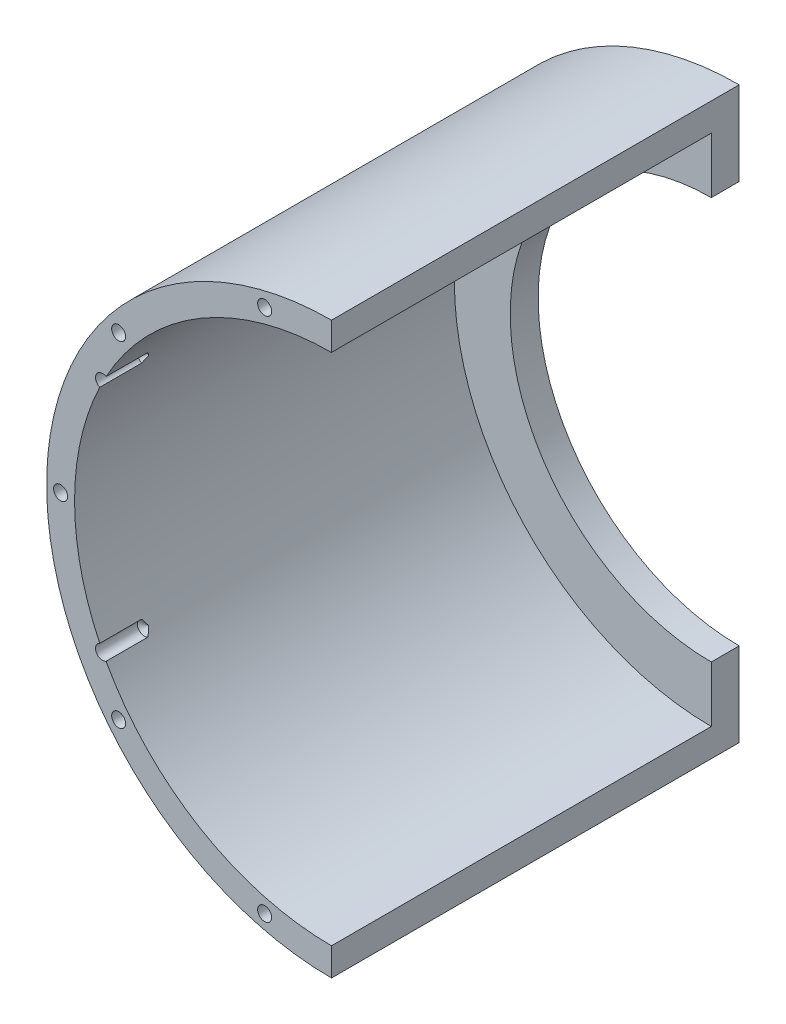
ISO-10303-21;
HEADER;
FILE_DESCRIPTION(('STEP AP214'),'2;1');
FILE_NAME('part.step','',(''),(''),'','','');
FILE_SCHEMA(('AUTOMOTIVE_DESIGN { 1 0 10303 214 1 1 1 1 }'));
ENDSEC;
DATA;
#1=APPLICATION_CONTEXT('core data for automotive mechanical design processes');
#2=APPLICATION_PROTOCOL_DEFINITION('international standard','automotive_design',2000,#1);
#3=PRODUCT_CONTEXT('',#1,'mechanical');
#4=PRODUCT('Part','Part','',(#3));
#5=PRODUCT_RELATED_PRODUCT_CATEGORY('part','',(#4));
#6=PRODUCT_DEFINITION_FORMATION('','',#4);
#7=PRODUCT_DEFINITION_CONTEXT('part definition',#1,'design');
#8=PRODUCT_DEFINITION('design','',#6,#7);
#9=PRODUCT_DEFINITION_SHAPE('','',#8);
#10=(LENGTH_UNIT() NAMED_UNIT(*) SI_UNIT(.MILLI.,.METRE.));
#11=(NAMED_UNIT(*) PLANE_ANGLE_UNIT() SI_UNIT($,.RADIAN.));
#12=(NAMED_UNIT(*) SI_UNIT($,.STERADIAN.) SOLID_ANGLE_UNIT());
#13=UNCERTAINTY_MEASURE_WITH_UNIT(LENGTH_MEASURE(1.E-05),#10,'distance_accuracy_value','');
#14=(GEOMETRIC_REPRESENTATION_CONTEXT(3) GLOBAL_UNCERTAINTY_ASSIGNED_CONTEXT((#13)) GLOBAL_UNIT_ASSIGNED_CONTEXT((#10,
#11,#12)) REPRESENTATION_CONTEXT('',''));
#15=CARTESIAN_POINT('',(0.,0.,0.));
#16=DIRECTION('',(0.,0.,1.));
#17=DIRECTION('',(1.,0.,0.));
#18=AXIS2_PLACEMENT_3D('',#15,#16,#17);
#19=CARTESIAN_POINT('',(0.,-46.,34.));
#20=DIRECTION('',(-1.,0.,0.));
#21=DIRECTION('',(0.,-1.,0.));
#22=AXIS2_PLACEMENT_3D('',#19,#20,#21);
#23=PLANE('',#22);
#24=DIRECTION('',(0.,1.,0.));
#25=VECTOR('',#24,1.);
#26=CARTESIAN_POINT('',(0.,-46.,34.));
#27=LINE('',#26,#25);
#28=CARTESIAN_POINT('',(0.,46.,34.));
#29=VERTEX_POINT('',#28);
#30=CARTESIAN_POINT('',(0.,51.,34.));
#31=VERTEX_POINT('',#30);
#32=EDGE_CURVE('E203',#29,#31,#27,.T.);
#33=ORIENTED_EDGE('',*,*,#32,.F.);
#34=DIRECTION('',(0.,0.,-1.));
#35=VECTOR('',#34,1.);
#36=CARTESIAN_POINT('',(0.,46.,34.));
#37=LINE('',#36,#35);
#38=CARTESIAN_POINT('',(0.,46.,-34.));
#39=VERTEX_POINT('',#38);
#40=EDGE_CURVE('E264',#29,#39,#37,.T.);
#41=ORIENTED_EDGE('',*,*,#40,.T.);
#42=DIRECTION('',(0.,-1.,0.));
#43=VECTOR('',#42,1.);
#44=CARTESIAN_POINT('',(0.,51.,-34.));
#45=LINE('',#44,#43);
#46=CARTESIAN_POINT('',(0.,36.,-34.));
#47=VERTEX_POINT('',#46);
#48=EDGE_CURVE('E217',#39,#47,#45,.T.);
#49=ORIENTED_EDGE('',*,*,#48,.T.);
#50=DIRECTION('',(0.,0.,1.));
#51=VECTOR('',#50,1.);
#52=CARTESIAN_POINT('',(0.,36.,-39.));
#53=LINE('',#52,#51);
#54=CARTESIAN_POINT('',(0.,36.,-39.));
#55=VERTEX_POINT('',#54);
#56=EDGE_CURVE('E591',#55,#47,#53,.T.);
#57=ORIENTED_EDGE('',*,*,#56,.F.);
#58=DIRECTION('',(0.,-1.,0.));
#59=VECTOR('',#58,1.);
#60=CARTESIAN_POINT('',(0.,51.,-39.));
#61=LINE('',#60,#59);
#62=CARTESIAN_POINT('',(0.,51.,-39.));
#63=VERTEX_POINT('',#62);
#64=EDGE_CURVE('E221',#63,#55,#61,.T.);
#65=ORIENTED_EDGE('',*,*,#64,.F.);
#66=DIRECTION('',(0.,0.,-1.));
#67=VECTOR('',#66,1.);
#68=CARTESIAN_POINT('',(0.,51.,34.));
#69=LINE('',#68,#67);
#70=EDGE_CURVE('E304',#31,#63,#69,.T.);
#71=ORIENTED_EDGE('',*,*,#70,.F.);
#72=EDGE_LOOP('',(#33,#41,#49,#57,#65,#71));
#73=FACE_BOUND('',#72,.T.);
#74=ADVANCED_FACE('F65',(#73),#23,.F.);
#75=DIRECTION('',(0.,1.,0.));
#76=VECTOR('',#75,1.);
#77=CARTESIAN_POINT('',(0.,-46.,34.));
#78=LINE('',#77,#76);
#79=CARTESIAN_POINT('',(0.,-51.,34.));
#80=VERTEX_POINT('',#79);
#81=CARTESIAN_POINT('',(0.,-46.,34.));
#82=VERTEX_POINT('',#81);
#83=EDGE_CURVE('E211',#80,#82,#78,.T.);
#84=ORIENTED_EDGE('',*,*,#83,.F.);
#85=DIRECTION('',(0.,0.,-1.));
#86=VECTOR('',#85,1.);
#87=CARTESIAN_POINT('',(0.,-51.,34.));
#88=LINE('',#87,#86);
#89=CARTESIAN_POINT('',(0.,-51.,-39.));
#90=VERTEX_POINT('',#89);
#91=EDGE_CURVE('E306',#80,#90,#88,.T.);
#92=ORIENTED_EDGE('',*,*,#91,.T.);
#93=DIRECTION('',(0.,-1.,0.));
#94=VECTOR('',#93,1.);
#95=CARTESIAN_POINT('',(0.,-51.,-39.));
#96=LINE('',#95,#94);
#97=CARTESIAN_POINT('',(0.,-36.,-39.));
#98=VERTEX_POINT('',#97);
#99=EDGE_CURVE('E226',#98,#90,#96,.T.);
#100=ORIENTED_EDGE('',*,*,#99,.F.);
#101=DIRECTION('',(0.,0.,1.));
#102=VECTOR('',#101,1.);
#103=CARTESIAN_POINT('',(0.,-36.,-39.));
#104=LINE('',#103,#102);
#105=CARTESIAN_POINT('',(0.,-36.,-34.));
#106=VERTEX_POINT('',#105);
#107=EDGE_CURVE('E229',#98,#106,#104,.T.);
#108=ORIENTED_EDGE('',*,*,#107,.T.);
#109=DIRECTION('',(0.,-1.,0.));
#110=VECTOR('',#109,1.);
#111=CARTESIAN_POINT('',(0.,-51.,-34.));
#112=LINE('',#111,#110);
#113=CARTESIAN_POINT('',(0.,-46.,-34.));
#114=VERTEX_POINT('',#113);
#115=EDGE_CURVE('E222',#106,#114,#112,.T.);
#116=ORIENTED_EDGE('',*,*,#115,.T.);
#117=DIRECTION('',(0.,0.,-1.));
#118=VECTOR('',#117,1.);
#119=CARTESIAN_POINT('',(0.,-46.,34.));
#120=LINE('',#119,#118);
#121=EDGE_CURVE('E315',#82,#114,#120,.T.);
#122=ORIENTED_EDGE('',*,*,#121,.F.);
#123=EDGE_LOOP('',(#84,#92,#100,#108,#116,#122));
#124=FACE_BOUND('',#123,.T.);
#125=ADVANCED_FACE('F288',(#124),#23,.F.);
#126=CARTESIAN_POINT('',(0.,0.,34.));
#127=DIRECTION('',(0.,0.,-1.));
#128=DIRECTION('',(-1.,0.,0.));
#129=AXIS2_PLACEMENT_3D('',#126,#127,#128);
#130=CYLINDRICAL_SURFACE('',#129,51.);
#131=CARTESIAN_POINT('',(0.,0.,34.));
#132=DIRECTION('',(0.,0.,1.));
#133=DIRECTION('',(1.,0.,0.));
#134=AXIS2_PLACEMENT_3D('',#131,#132,#133);
#135=CIRCLE('',#134,51.);
#136=EDGE_CURVE('E209',#31,#80,#135,.T.);
#137=ORIENTED_EDGE('',*,*,#136,.F.);
#138=ORIENTED_EDGE('',*,*,#70,.T.);
#139=CARTESIAN_POINT('',(0.,0.,-39.));
#140=DIRECTION('',(0.,0.,-1.));
#141=DIRECTION('',(-1.,0.,0.));
#142=AXIS2_PLACEMENT_3D('',#139,#140,#141);
#143=CIRCLE('',#142,51.);
#144=EDGE_CURVE('E218',#90,#63,#143,.T.);
#145=ORIENTED_EDGE('',*,*,#144,.F.);
#146=ORIENTED_EDGE('',*,*,#91,.F.);
#147=EDGE_LOOP('',(#137,#138,#145,#146));
#148=FACE_BOUND('',#147,.T.);
#149=ADVANCED_FACE('F290',(#148),#130,.T.);
#150=CARTESIAN_POINT('',(-41.,-21.,39.));
#151=DIRECTION('',(0.,0.,1.));
#152=DIRECTION('',(1.,0.,0.));
#153=AXIS2_PLACEMENT_3D('',#150,#151,#152);
#154=CYLINDRICAL_SURFACE('',#153,1.24999999999999);
#155=CARTESIAN_POINT('',(-41.,-21.,34.));
#156=DIRECTION('',(0.,0.,1.));
#157=DIRECTION('',(1.,0.,0.));
#158=AXIS2_PLACEMENT_3D('',#155,#156,#157);
#159=CIRCLE('',#158,1.24999999999999);
#160=CARTESIAN_POINT('',(-40.358326126474,-22.0727323245032,34.));
#161=VERTEX_POINT('',#160);
#162=CARTESIAN_POINT('',(-41.4955558245157,-19.8524267235646,34.));
#163=VERTEX_POINT('',#162);
#164=EDGE_CURVE('E205',#161,#163,#159,.F.);
#165=ORIENTED_EDGE('',*,*,#164,.F.);
#166=DIRECTION('',(0.,0.,1.));
#167=VECTOR('',#166,1.);
#168=CARTESIAN_POINT('',(-40.358326126474,-22.0727323245032,32.75));
#169=LINE('',#168,#167);
#170=CARTESIAN_POINT('',(-40.358326126474,-22.0727323245032,26.5));
#171=VERTEX_POINT('',#170);
#172=EDGE_CURVE('E263',#171,#161,#169,.T.);
#173=ORIENTED_EDGE('',*,*,#172,.F.);
#174=CARTESIAN_POINT('',(-41.,-21.,26.5));
#175=DIRECTION('',(0.,0.,1.));
#176=DIRECTION('',(1.,0.,0.));
#177=AXIS2_PLACEMENT_3D('',#174,#175,#176);
#178=CIRCLE('',#177,1.24999999999999);
#179=CARTESIAN_POINT('',(-41.4955558245157,-19.8524267235647,26.5));
#180=VERTEX_POINT('',#179);
#181=EDGE_CURVE('E87',#180,#171,#178,.T.);
#182=ORIENTED_EDGE('',*,*,#181,.F.);
#183=DIRECTION('',(0.,0.,1.));
#184=VECTOR('',#183,1.);
#185=CARTESIAN_POINT('',(-41.4955558245157,-19.8524267235647,32.75));
#186=LINE('',#185,#184);
#187=EDGE_CURVE('E329',#163,#180,#186,.F.);
#188=ORIENTED_EDGE('',*,*,#187,.F.);
#189=EDGE_LOOP('',(#165,#173,#182,#188));
#190=FACE_BOUND('',#189,.T.);
#191=ADVANCED_FACE('F274',(#190),#154,.F.);
#192=CARTESIAN_POINT('',(-41.,21.,39.));
#193=DIRECTION('',(0.,0.,1.));
#194=DIRECTION('',(1.,0.,0.));
#195=AXIS2_PLACEMENT_3D('',#192,#193,#194);
#196=CYLINDRICAL_SURFACE('',#195,1.24999999999999);
#197=CARTESIAN_POINT('',(-41.,21.,34.));
#198=DIRECTION('',(0.,0.,1.));
#199=DIRECTION('',(1.,0.,0.));
#200=AXIS2_PLACEMENT_3D('',#197,#198,#199);
#201=CIRCLE('',#200,1.24999999999999);
#202=CARTESIAN_POINT('',(-41.4955558245157,19.8524267235646,34.));
#203=VERTEX_POINT('',#202);
#204=CARTESIAN_POINT('',(-40.358326126474,22.0727323245032,34.));
#205=VERTEX_POINT('',#204);
#206=EDGE_CURVE('E201',#203,#205,#201,.F.);
#207=ORIENTED_EDGE('',*,*,#206,.F.);
#208=DIRECTION('',(0.,0.,1.));
#209=VECTOR('',#208,1.);
#210=CARTESIAN_POINT('',(-41.4955558245157,19.8524267235646,32.75));
#211=LINE('',#210,#209);
#212=CARTESIAN_POINT('',(-41.4955558245157,19.8524267235646,26.5));
#213=VERTEX_POINT('',#212);
#214=EDGE_CURVE('E74',#213,#203,#211,.T.);
#215=ORIENTED_EDGE('',*,*,#214,.F.);
#216=CARTESIAN_POINT('',(-41.,21.,26.5));
#217=DIRECTION('',(0.,0.,1.));
#218=DIRECTION('',(1.,0.,0.));
#219=AXIS2_PLACEMENT_3D('',#216,#217,#218);
#220=CIRCLE('',#219,1.24999999999999);
#221=CARTESIAN_POINT('',(-40.358326126474,22.0727323245032,26.5));
#222=VERTEX_POINT('',#221);
#223=EDGE_CURVE('E80',#222,#213,#220,.T.);
#224=ORIENTED_EDGE('',*,*,#223,.F.);
#225=DIRECTION('',(0.,0.,1.));
#226=VECTOR('',#225,1.);
#227=CARTESIAN_POINT('',(-40.358326126474,22.0727323245032,32.75));
#228=LINE('',#227,#226);
#229=EDGE_CURVE('E12',#205,#222,#228,.F.);
#230=ORIENTED_EDGE('',*,*,#229,.F.);
#231=EDGE_LOOP('',(#207,#215,#224,#230));
#232=FACE_BOUND('',#231,.T.);
#233=ADVANCED_FACE('F297',(#232),#196,.F.);
#234=CARTESIAN_POINT('',(0.,0.,34.));
#235=DIRECTION('',(0.,0.,-1.));
#236=DIRECTION('',(-1.,0.,0.));
#237=AXIS2_PLACEMENT_3D('',#234,#235,#236);
#238=CYLINDRICAL_SURFACE('',#237,46.);
#239=CARTESIAN_POINT('',(0.,0.,34.));
#240=DIRECTION('',(0.,0.,-1.));
#241=DIRECTION('',(1.,0.,0.));
#242=AXIS2_PLACEMENT_3D('',#239,#240,#241);
#243=CIRCLE('',#242,46.);
#244=EDGE_CURVE('E253',#205,#29,#243,.T.);
#245=ORIENTED_EDGE('',*,*,#244,.F.);
#246=ORIENTED_EDGE('',*,*,#229,.T.);
#247=CARTESIAN_POINT('',(-40.3581662881887,22.0730245742378,26.5002000000003));
#248=CARTESIAN_POINT('',(-40.4056591400927,21.986188375574,26.4407981539228));
#249=CARTESIAN_POINT('',(-40.4528672625057,21.8992082348738,26.3813786853316));
#250=CARTESIAN_POINT('',(-40.5467178308254,21.7249503790775,26.2626373794061));
#251=CARTESIAN_POINT('',(-40.5933605380652,21.6376728273593,26.2033155088457));
#252=CARTESIAN_POINT('',(-40.6643596524955,21.5037813764192,26.1126463000426));
#253=CARTESIAN_POINT('',(-40.6889014878829,21.4573078367323,26.08123677558));
#254=CARTESIAN_POINT('',(-40.737863703566,21.3642044025431,26.0185170356506));
#255=CARTESIAN_POINT('',(-40.7622840430216,21.3175744632644,25.9872068547102));
#256=CARTESIAN_POINT('',(-40.7995025574077,21.2462081579924,25.939683194919));
#257=CARTESIAN_POINT('',(-40.8123249066988,21.2215671262483,25.92334608047));
#258=CARTESIAN_POINT('',(-40.8315662069399,21.1845083608551,25.8990217345553));
#259=CARTESIAN_POINT('',(-40.8379785778444,21.1721444436477,25.8909471898549));
#260=CARTESIAN_POINT('',(-40.8508201390194,21.1473565481747,25.8748925904273));
#261=CARTESIAN_POINT('',(-40.8572493340429,21.1349325518432,25.8669125669784));
#262=CARTESIAN_POINT('',(-40.8705553391752,21.1091906382841,25.8506294405905));
#263=CARTESIAN_POINT('',(-40.8774344517482,21.0958664190659,25.8423383670526));
#264=CARTESIAN_POINT('',(-40.8912819064952,21.0690126288301,25.8261769583568));
#265=CARTESIAN_POINT('',(-40.8982501789409,21.0554832169141,25.8183063166745));
#266=CARTESIAN_POINT('',(-40.9093160906505,21.0339709044562,25.8070212985044));
#267=CARTESIAN_POINT('',(-40.913324350248,21.0261734639309,25.8031724997403));
#268=CARTESIAN_POINT('',(-40.9214829958366,21.0102905480402,25.7963231069303));
#269=CARTESIAN_POINT('',(-40.9256328296277,21.0022061877026,25.7933195640453));
#270=CARTESIAN_POINT('',(-40.932959656727,20.9879217361067,25.7896878438891));
#271=CARTESIAN_POINT('',(-40.9360891681276,20.9818171628462,25.7886329354238));
#272=CARTESIAN_POINT('',(-40.9423701775949,20.9695582040475,25.787872002997));
#273=CARTESIAN_POINT('',(-40.9455215178815,20.9634041568119,25.7881600521601));
#274=CARTESIAN_POINT('',(-40.9530027986337,20.9487864654115,25.7903011504695));
#275=CARTESIAN_POINT('',(-40.9572917273404,20.9403996679733,25.7927421753707));
#276=CARTESIAN_POINT('',(-40.965716464637,20.9239136407395,25.7988455004899));
#277=CARTESIAN_POINT('',(-40.9698494587969,20.9158197559503,25.802523695133));
#278=CARTESIAN_POINT('',(-40.9786435570161,20.898585588761,25.8110550710831));
#279=CARTESIAN_POINT('',(-40.9832847131759,20.8894824454648,25.8160020810258));
#280=CARTESIAN_POINT('',(-40.9924824947253,20.871427394697,25.8262422333608));
#281=CARTESIAN_POINT('',(-40.9970390692929,20.8624755784235,25.8315355757271));
#282=CARTESIAN_POINT('',(-41.0106472241885,20.835719702975,25.8476923696815));
#283=CARTESIAN_POINT('',(-41.0196254193265,20.8180383769816,25.8588197500404));
#284=CARTESIAN_POINT('',(-41.037437763474,20.7829037018038,25.8812458793439));
#285=CARTESIAN_POINT('',(-41.04627246676,20.7654496177878,25.8925430743676));
#286=CARTESIAN_POINT('',(-41.0638797097809,20.7306093464838,25.9152528323286));
#287=CARTESIAN_POINT('',(-41.0726522954914,20.7132231144846,25.926665290408));
#288=CARTESIAN_POINT('',(-41.0990138756087,20.6608952003559,25.9611320698288));
#289=CARTESIAN_POINT('',(-41.1165434834435,20.6259878866905,25.9842835434159));
#290=CARTESIAN_POINT('',(-41.1514878809008,20.5561807720399,26.0306853004191));
#291=CARTESIAN_POINT('',(-41.1689026689803,20.5212809711618,26.0539355851562));
#292=CARTESIAN_POINT('',(-41.2210083476976,20.4165265730239,26.1237780354757));
#293=CARTESIAN_POINT('',(-41.2555465577602,20.3466447615779,26.1704433330048));
#294=CARTESIAN_POINT('',(-41.3245805110035,20.2060692516428,26.2642823335018));
#295=CARTESIAN_POINT('',(-41.359072676764,20.1353741893718,26.3114566237853));
#296=CARTESIAN_POINT('',(-41.4276704818077,19.9938565184088,26.40581954973));
#297=CARTESIAN_POINT('',(-41.4617762783305,19.9230339762713,26.4530081708957));
#298=CARTESIAN_POINT('',(-41.4956995825594,19.8521262376094,26.5002));
#299=B_SPLINE_CURVE_WITH_KNOTS('',3,(#247,#248,#249,#250,#251,#252,#253,#254,#255,#256,#257,
#258,#259,#260,#261,#262,#263,#264,#265,#266,#267,#268,#269,#270,#271,#272,#273,#274,#275,#276,
#277,#278,#279,#280,#281,#282,#283,#284,#285,#286,#287,#288,#289,#290,#291,#292,#293,#294,#295,
#296,#297,#298),.UNSPECIFIED.,.F.,.F.,(4,2,2,2,2,2,2,2,2,2,2,2,2,2,2,2,2,2,2,2,2,2,2,2,2,4),(0.,
0.346297626729391,0.692428574597794,0.876106960281887,1.05984340127643,1.15651958106123,
1.2048171621044,1.25313030241494,1.30453688846743,1.35590546910834,1.38461843087909,
1.41322994370119,1.43394754258357,1.45457379524913,1.4835753390348,1.51296469176752,
1.54700560504167,1.58106635019322,1.64927477236469,1.71704635975225,1.78476103031179,
1.92098173986935,2.05720427660667,2.32975787197595,2.60492283840184,2.87997147885422),.UNSPECIFIED.);
#300=EDGE_CURVE('E332',#222,#213,#299,.T.);
#301=ORIENTED_EDGE('',*,*,#300,.T.);
#302=ORIENTED_EDGE('',*,*,#214,.T.);
#303=EDGE_CURVE('E250',#163,#203,#243,.T.);
#304=ORIENTED_EDGE('',*,*,#303,.F.);
#305=ORIENTED_EDGE('',*,*,#187,.T.);
#306=CARTESIAN_POINT('',(-41.4956995825594,-19.8521262376095,26.5002));
#307=CARTESIAN_POINT('',(-41.4529847862643,-19.9414097330484,26.4407981539225));
#308=CARTESIAN_POINT('',(-41.4099867982843,-20.0305462840679,26.3813786853314));
#309=CARTESIAN_POINT('',(-41.3234187855771,-20.2085342293242,26.2626373794059));
#310=CARTESIAN_POINT('',(-41.279849046142,-20.2973857401619,26.2033155088454));
#311=CARTESIAN_POINT('',(-41.2126849666767,-20.4332414773035,26.1126463000424));
#312=CARTESIAN_POINT('',(-41.1893128839904,-20.4803141586177,26.0812367755799));
#313=CARTESIAN_POINT('',(-41.1423708640909,-20.5744523272326,26.0185170356505));
#314=CARTESIAN_POINT('',(-41.1188008666766,-20.6215178075569,25.9872068547101));
#315=CARTESIAN_POINT('',(-41.0826360128409,-20.6934237926229,25.9396831949189));
#316=CARTESIAN_POINT('',(-41.0701326464213,-20.7182282058377,25.9233460804699));
#317=CARTESIAN_POINT('',(-41.0513032488208,-20.7554979457542,25.8990217345552));
#318=CARTESIAN_POINT('',(-41.045017044528,-20.7679264848846,25.8909471898548));
#319=CARTESIAN_POINT('',(-41.0324057249485,-20.7928323089798,25.8748925904273));
#320=CARTESIAN_POINT('',(-41.0260805977791,-20.8053096083584,25.8669125669784));
#321=CARTESIAN_POINT('',(-41.0129664937335,-20.8311498127179,25.8506294405904));
#322=CARTESIAN_POINT('',(-41.0061737482559,-20.8445182687412,25.8423383670525));
#323=CARTESIAN_POINT('',(-40.9924737563145,-20.8714475887067,25.8261769583568));
#324=CARTESIAN_POINT('',(-40.9855665982152,-20.8850083030928,25.8183063166745));
#325=CARTESIAN_POINT('',(-40.9745758010745,-20.9065590888664,25.8070212985044));
#326=CARTESIAN_POINT('',(-40.9705904331746,-20.9143682544076,25.8031724997402));
#327=CARTESIAN_POINT('',(-40.9624690096902,-20.9302702352784,25.7963231069303));
#328=CARTESIAN_POINT('',(-40.9583335362687,-20.9383619509273,25.7933195640453));
#329=CARTESIAN_POINT('',(-40.9510231875199,-20.952654842654,25.7896878438891));
#330=CARTESIAN_POINT('',(-40.9478980786519,-20.9587616708702,25.7886329354238));
#331=CARTESIAN_POINT('',(-40.9416202863277,-20.9710222774739,25.787872002997));
#332=CARTESIAN_POINT('',(-40.9384677852041,-20.9771757301344,25.7881600521601));
#333=CARTESIAN_POINT('',(-40.9309772684941,-20.9917886909222,25.7903011504695));
#334=CARTESIAN_POINT('',(-40.9266776485166,-21.0001700123437,25.7927421753707));
#335=CARTESIAN_POINT('',(-40.9182222928857,-21.016640357016,25.7988455004899));
#336=CARTESIAN_POINT('',(-40.9140692500729,-21.0247239729831,25.802523695133));
#337=CARTESIAN_POINT('',(-40.9052226175996,-21.0419312323837,25.8110550710831));
#338=CARTESIAN_POINT('',(-40.900547509627,-21.051016985727,25.8160020810258));
#339=CARTESIAN_POINT('',(-40.8912706254135,-21.0690315204962,25.8262422333608));
#340=CARTESIAN_POINT('',(-40.8866688934817,-21.077960207388,25.8315355757271));
#341=CARTESIAN_POINT('',(-40.8729085233348,-21.1046381189274,25.8476923696816));
#342=CARTESIAN_POINT('',(-40.8638065999656,-21.1222560719243,25.8588197500405));
#343=CARTESIAN_POINT('',(-40.8457035820988,-21.1572418654411,25.8812458793441));
#344=CARTESIAN_POINT('',(-40.8367022151804,-21.1746105851576,25.8925430743677));
#345=CARTESIAN_POINT('',(-40.8187182538988,-21.2092579032061,25.9152528323287));
#346=CARTESIAN_POINT('',(-40.8097356501185,-21.2265365649745,25.9266652904082));
#347=CARTESIAN_POINT('',(-40.7826761266576,-21.2785069959272,25.961132069829));
#348=CARTESIAN_POINT('',(-40.7645923941332,-21.3131304896296,25.9842835434161));
#349=CARTESIAN_POINT('',(-40.7283639310883,-21.3822799121501,26.0306853004193));
#350=CARTESIAN_POINT('',(-40.710219199753,-21.4168058396532,26.0539355851565));
#351=CARTESIAN_POINT('',(-40.6556593354815,-21.5203032159219,26.1237780354759));
#352=CARTESIAN_POINT('',(-40.6191328987085,-21.5891666673456,26.1704433330051));
#353=CARTESIAN_POINT('',(-40.5453963642661,-21.72733353813,26.2642823335021));
#354=CARTESIAN_POINT('',(-40.5081830694087,-21.7966348513513,26.3114566237856));
#355=CARTESIAN_POINT('',(-40.4334271075122,-21.9349983444142,26.4058195497303));
#356=CARTESIAN_POINT('',(-40.395884586366,-22.0040606129641,26.453008170896));
#357=CARTESIAN_POINT('',(-40.3581662881887,-22.0730245742378,26.5002000000003));
#358=B_SPLINE_CURVE_WITH_KNOTS('',3,(#306,#307,#308,#309,#310,#311,#312,#313,#314,#315,#316,
#317,#318,#319,#320,#321,#322,#323,#324,#325,#326,#327,#328,#329,#330,#331,#332,#333,#334,#335,
#336,#337,#338,#339,#340,#341,#342,#343,#344,#345,#346,#347,#348,#349,#350,#351,#352,#353,#354,
#355,#356,#357),.UNSPECIFIED.,.F.,.F.,(4,2,2,2,2,2,2,2,2,2,2,2,2,2,2,2,2,2,2,2,2,2,2,2,2,4),(0.,
0.346297626729234,0.692428574597492,0.876106960281501,1.05984340127595,1.15651958106071,
1.20481716210386,1.25313030241438,1.30453688846684,1.35590546910773,1.38461843087848,
1.41322994370057,1.43394754258295,1.4545737952485,1.48357533903418,1.51296469176693,
1.54700560504111,1.58106635019271,1.64927477236424,1.71704635975188,1.7847610303115,
1.92098173986909,2.05720427660645,2.32975787197579,2.60492283840176,2.87997147885421),.UNSPECIFIED.);
#359=EDGE_CURVE('E256',#180,#171,#358,.T.);
#360=ORIENTED_EDGE('',*,*,#359,.T.);
#361=ORIENTED_EDGE('',*,*,#172,.T.);
#362=EDGE_CURVE('E245',#82,#161,#243,.T.);
#363=ORIENTED_EDGE('',*,*,#362,.F.);
#364=ORIENTED_EDGE('',*,*,#121,.T.);
#365=CARTESIAN_POINT('',(0.,0.,-34.));
#366=DIRECTION('',(0.,0.,-1.));
#367=DIRECTION('',(1.,0.,0.));
#368=AXIS2_PLACEMENT_3D('',#365,#366,#367);
#369=CIRCLE('',#368,46.);
#370=EDGE_CURVE('E254',#114,#39,#369,.T.);
#371=ORIENTED_EDGE('',*,*,#370,.T.);
#372=ORIENTED_EDGE('',*,*,#40,.F.);
#373=EDGE_LOOP('',(#245,#246,#301,#302,#304,#305,#360,#361,#363,#364,#371,#372));
#374=FACE_BOUND('',#373,.T.);
#375=ADVANCED_FACE('F67',(#374),#238,.F.);
#376=CARTESIAN_POINT('',(0.,0.,-39.));
#377=DIRECTION('',(0.,0.,1.));
#378=DIRECTION('',(1.,0.,0.));
#379=AXIS2_PLACEMENT_3D('',#376,#377,#378);
#380=CYLINDRICAL_SURFACE('',#379,36.);
#381=CARTESIAN_POINT('',(0.,0.,-34.));
#382=DIRECTION('',(0.,0.,1.));
#383=DIRECTION('',(-1.,0.,0.));
#384=AXIS2_PLACEMENT_3D('',#381,#382,#383);
#385=CIRCLE('',#384,36.);
#386=EDGE_CURVE('E232',#47,#106,#385,.T.);
#387=ORIENTED_EDGE('',*,*,#386,.T.);
#388=ORIENTED_EDGE('',*,*,#107,.F.);
#389=CARTESIAN_POINT('',(0.,0.,-39.));
#390=DIRECTION('',(0.,0.,1.));
#391=DIRECTION('',(-1.,0.,0.));
#392=AXIS2_PLACEMENT_3D('',#389,#390,#391);
#393=CIRCLE('',#392,36.);
#394=EDGE_CURVE('E224',#55,#98,#393,.T.);
#395=ORIENTED_EDGE('',*,*,#394,.F.);
#396=ORIENTED_EDGE('',*,*,#56,.T.);
#397=EDGE_LOOP('',(#387,#388,#395,#396));
#398=FACE_BOUND('',#397,.T.);
#399=ADVANCED_FACE('F279',(#398),#380,.F.);
#400=CARTESIAN_POINT('',(0.,0.,-39.));
#401=DIRECTION('',(0.,0.,-1.));
#402=DIRECTION('',(-1.,0.,0.));
#403=AXIS2_PLACEMENT_3D('',#400,#401,#402);
#404=PLANE('',#403);
#405=ORIENTED_EDGE('',*,*,#144,.T.);
#406=ORIENTED_EDGE('',*,*,#64,.T.);
#407=ORIENTED_EDGE('',*,*,#394,.T.);
#408=ORIENTED_EDGE('',*,*,#99,.T.);
#409=EDGE_LOOP('',(#405,#406,#407,#408));
#410=FACE_BOUND('',#409,.T.);
#411=ADVANCED_FACE('F276',(#410),#404,.T.);
#412=CARTESIAN_POINT('',(0.,0.,-34.));
#413=DIRECTION('',(0.,0.,-1.));
#414=DIRECTION('',(-1.,0.,0.));
#415=AXIS2_PLACEMENT_3D('',#412,#413,#414);
#416=PLANE('',#415);
#417=ORIENTED_EDGE('',*,*,#370,.F.);
#418=ORIENTED_EDGE('',*,*,#115,.F.);
#419=ORIENTED_EDGE('',*,*,#386,.F.);
#420=ORIENTED_EDGE('',*,*,#48,.F.);
#421=EDGE_LOOP('',(#417,#418,#419,#420));
#422=FACE_BOUND('',#421,.T.);
#423=ADVANCED_FACE('F272',(#422),#416,.F.);
#424=CARTESIAN_POINT('',(-41.,-21.,26.5));
#425=DIRECTION('',(0.,0.,1.));
#426=DIRECTION('',(1.,0.,0.));
#427=AXIS2_PLACEMENT_3D('',#424,#425,#426);
#428=CONICAL_SURFACE('',#427,1.24999999999999,1.02974425867665);
#429=CARTESIAN_POINT('',(-41.,-21.,25.7489242262155));
#430=VERTEX_POINT('',#429);
#431=VERTEX_LOOP('',#430);
#432=FACE_BOUND('',#431,.T.);
#433=ORIENTED_EDGE('',*,*,#181,.T.);
#434=ORIENTED_EDGE('',*,*,#359,.F.);
#435=EDGE_LOOP('',(#433,#434));
#436=FACE_BOUND('',#435,.T.);
#437=ADVANCED_FACE('F266',(#432,#436),#428,.F.);
#438=CARTESIAN_POINT('',(-41.,21.,26.5));
#439=DIRECTION('',(0.,0.,1.));
#440=DIRECTION('',(1.,0.,0.));
#441=AXIS2_PLACEMENT_3D('',#438,#439,#440);
#442=CONICAL_SURFACE('',#441,1.24999999999999,1.02974425867665);
#443=CARTESIAN_POINT('',(-41.,21.,25.7489242262155));
#444=VERTEX_POINT('',#443);
#445=VERTEX_LOOP('',#444);
#446=FACE_BOUND('',#445,.T.);
#447=ORIENTED_EDGE('',*,*,#223,.T.);
#448=ORIENTED_EDGE('',*,*,#300,.F.);
#449=EDGE_LOOP('',(#447,#448));
#450=FACE_BOUND('',#449,.T.);
#451=ADVANCED_FACE('F271',(#446,#450),#442,.F.);
#452=CARTESIAN_POINT('',(0.,0.,34.));
#453=DIRECTION('',(0.,0.,1.));
#454=DIRECTION('',(1.,0.,0.));
#455=AXIS2_PLACEMENT_3D('',#452,#453,#454);
#456=PLANE('',#455);
#457=CARTESIAN_POINT('',(-11.9687092035859,-47.,34.));
#458=DIRECTION('',(0.,0.,1.));
#459=DIRECTION('',(1.,0.,0.));
#460=AXIS2_PLACEMENT_3D('',#457,#458,#459);
#461=CIRCLE('',#460,1.24999999999999);
#462=CARTESIAN_POINT('',(-10.7187092035859,-47.,34.));
#463=VERTEX_POINT('',#462);
#464=EDGE_CURVE('E173',#463,#463,#461,.T.);
#465=ORIENTED_EDGE('',*,*,#464,.F.);
#466=EDGE_LOOP('',(#465));
#467=FACE_BOUND('',#466,.T.);
#468=CARTESIAN_POINT('',(-38.1083980245825,-30.,34.));
#469=DIRECTION('',(0.,0.,1.));
#470=DIRECTION('',(1.,0.,0.));
#471=AXIS2_PLACEMENT_3D('',#468,#469,#470);
#472=CIRCLE('',#471,1.24999999999999);
#473=CARTESIAN_POINT('',(-36.8583980245825,-30.,34.));
#474=VERTEX_POINT('',#473);
#475=EDGE_CURVE('E172',#474,#474,#472,.T.);
#476=ORIENTED_EDGE('',*,*,#475,.F.);
#477=EDGE_LOOP('',(#476));
#478=FACE_BOUND('',#477,.T.);
#479=CARTESIAN_POINT('',(-48.5,0.,34.));
#480=DIRECTION('',(0.,0.,1.));
#481=DIRECTION('',(1.,0.,0.));
#482=AXIS2_PLACEMENT_3D('',#479,#480,#481);
#483=CIRCLE('',#482,1.24999999999999);
#484=CARTESIAN_POINT('',(-47.25,0.,34.));
#485=VERTEX_POINT('',#484);
#486=EDGE_CURVE('E183',#485,#485,#483,.T.);
#487=ORIENTED_EDGE('',*,*,#486,.F.);
#488=EDGE_LOOP('',(#487));
#489=FACE_BOUND('',#488,.T.);
#490=CARTESIAN_POINT('',(-38.1083980245825,30.,34.));
#491=DIRECTION('',(0.,0.,1.));
#492=DIRECTION('',(1.,0.,0.));
#493=AXIS2_PLACEMENT_3D('',#490,#491,#492);
#494=CIRCLE('',#493,1.24999999999999);
#495=CARTESIAN_POINT('',(-36.8583980245825,30.,34.));
#496=VERTEX_POINT('',#495);
#497=EDGE_CURVE('E189',#496,#496,#494,.T.);
#498=ORIENTED_EDGE('',*,*,#497,.F.);
#499=EDGE_LOOP('',(#498));
#500=FACE_BOUND('',#499,.T.);
#501=CARTESIAN_POINT('',(-11.9687092035859,47.,34.));
#502=DIRECTION('',(0.,0.,1.));
#503=DIRECTION('',(1.,0.,0.));
#504=AXIS2_PLACEMENT_3D('',#501,#502,#503);
#505=CIRCLE('',#504,1.24999999999999);
#506=CARTESIAN_POINT('',(-10.7187092035859,47.,34.));
#507=VERTEX_POINT('',#506);
#508=EDGE_CURVE('E195',#507,#507,#505,.T.);
#509=ORIENTED_EDGE('',*,*,#508,.F.);
#510=EDGE_LOOP('',(#509));
#511=FACE_BOUND('',#510,.T.);
#512=ORIENTED_EDGE('',*,*,#362,.T.);
#513=ORIENTED_EDGE('',*,*,#164,.T.);
#514=ORIENTED_EDGE('',*,*,#303,.T.);
#515=ORIENTED_EDGE('',*,*,#206,.T.);
#516=ORIENTED_EDGE('',*,*,#244,.T.);
#517=ORIENTED_EDGE('',*,*,#32,.T.);
#518=ORIENTED_EDGE('',*,*,#136,.T.);
#519=ORIENTED_EDGE('',*,*,#83,.T.);
#520=EDGE_LOOP('',(#512,#513,#514,#515,#516,#517,#518,#519));
#521=FACE_BOUND('',#520,.T.);
#522=ADVANCED_FACE('F325',(#467,#478,#489,#500,#511,#521),#456,.T.);
#523=CARTESIAN_POINT('',(-11.9687092035859,47.,21.5));
#524=DIRECTION('',(0.,0.,1.));
#525=DIRECTION('',(1.,0.,0.));
#526=AXIS2_PLACEMENT_3D('',#523,#524,#525);
#527=CONICAL_SURFACE('',#526,1.24999999999999,1.02974425867665);
#528=CARTESIAN_POINT('',(-11.9687092035859,47.,20.7489242262156));
#529=VERTEX_POINT('',#528);
#530=VERTEX_LOOP('',#529);
#531=FACE_BOUND('',#530,.T.);
#532=CARTESIAN_POINT('',(-11.9687092035859,47.,21.5));
#533=DIRECTION('',(0.,0.,1.));
#534=DIRECTION('',(1.,0.,0.));
#535=AXIS2_PLACEMENT_3D('',#532,#533,#534);
#536=CIRCLE('',#535,1.24999999999999);
#537=CARTESIAN_POINT('',(-10.7187092035859,47.,21.5));
#538=VERTEX_POINT('',#537);
#539=EDGE_CURVE('E198',#538,#538,#536,.T.);
#540=ORIENTED_EDGE('',*,*,#539,.T.);
#541=EDGE_LOOP('',(#540));
#542=FACE_BOUND('',#541,.T.);
#543=ADVANCED_FACE('F347',(#531,#542),#527,.F.);
#544=CARTESIAN_POINT('',(-11.9687092035859,47.,34.));
#545=DIRECTION('',(0.,0.,1.));
#546=DIRECTION('',(1.,0.,0.));
#547=AXIS2_PLACEMENT_3D('',#544,#545,#546);
#548=CYLINDRICAL_SURFACE('',#547,1.24999999999999);
#549=ORIENTED_EDGE('',*,*,#539,.F.);
#550=EDGE_LOOP('',(#549));
#551=FACE_BOUND('',#550,.T.);
#552=ORIENTED_EDGE('',*,*,#508,.T.);
#553=EDGE_LOOP('',(#552));
#554=FACE_BOUND('',#553,.T.);
#555=ADVANCED_FACE('F351',(#551,#554),#548,.F.);
#556=CARTESIAN_POINT('',(-38.1083980245825,30.,21.5));
#557=DIRECTION('',(0.,0.,1.));
#558=DIRECTION('',(1.,0.,0.));
#559=AXIS2_PLACEMENT_3D('',#556,#557,#558);
#560=CONICAL_SURFACE('',#559,1.24999999999999,1.02974425867665);
#561=CARTESIAN_POINT('',(-38.1083980245825,30.,20.7489242262156));
#562=VERTEX_POINT('',#561);
#563=VERTEX_LOOP('',#562);
#564=FACE_BOUND('',#563,.T.);
#565=CARTESIAN_POINT('',(-38.1083980245825,30.,21.5));
#566=DIRECTION('',(0.,0.,1.));
#567=DIRECTION('',(1.,0.,0.));
#568=AXIS2_PLACEMENT_3D('',#565,#566,#567);
#569=CIRCLE('',#568,1.24999999999999);
#570=CARTESIAN_POINT('',(-36.8583980245825,30.,21.5));
#571=VERTEX_POINT('',#570);
#572=EDGE_CURVE('E192',#571,#571,#569,.T.);
#573=ORIENTED_EDGE('',*,*,#572,.T.);
#574=EDGE_LOOP('',(#573));
#575=FACE_BOUND('',#574,.T.);
#576=ADVANCED_FACE('F355',(#564,#575),#560,.F.);
#577=CARTESIAN_POINT('',(-38.1083980245825,30.,34.));
#578=DIRECTION('',(0.,0.,1.));
#579=DIRECTION('',(1.,0.,0.));
#580=AXIS2_PLACEMENT_3D('',#577,#578,#579);
#581=CYLINDRICAL_SURFACE('',#580,1.24999999999999);
#582=ORIENTED_EDGE('',*,*,#572,.F.);
#583=EDGE_LOOP('',(#582));
#584=FACE_BOUND('',#583,.T.);
#585=ORIENTED_EDGE('',*,*,#497,.T.);
#586=EDGE_LOOP('',(#585));
#587=FACE_BOUND('',#586,.T.);
#588=ADVANCED_FACE('F359',(#584,#587),#581,.F.);
#589=CARTESIAN_POINT('',(-48.5,0.,21.5));
#590=DIRECTION('',(0.,0.,1.));
#591=DIRECTION('',(1.,0.,0.));
#592=AXIS2_PLACEMENT_3D('',#589,#590,#591);
#593=CONICAL_SURFACE('',#592,1.24999999999999,1.02974425867665);
#594=CARTESIAN_POINT('',(-48.5,0.,20.7489242262156));
#595=VERTEX_POINT('',#594);
#596=VERTEX_LOOP('',#595);
#597=FACE_BOUND('',#596,.T.);
#598=CARTESIAN_POINT('',(-48.5,0.,21.5));
#599=DIRECTION('',(0.,0.,1.));
#600=DIRECTION('',(1.,0.,0.));
#601=AXIS2_PLACEMENT_3D('',#598,#599,#600);
#602=CIRCLE('',#601,1.24999999999999);
#603=CARTESIAN_POINT('',(-47.25,0.,21.5));
#604=VERTEX_POINT('',#603);
#605=EDGE_CURVE('E186',#604,#604,#602,.T.);
#606=ORIENTED_EDGE('',*,*,#605,.T.);
#607=EDGE_LOOP('',(#606));
#608=FACE_BOUND('',#607,.T.);
#609=ADVANCED_FACE('F363',(#597,#608),#593,.F.);
#610=CARTESIAN_POINT('',(-48.5,0.,34.));
#611=DIRECTION('',(0.,0.,1.));
#612=DIRECTION('',(1.,0.,0.));
#613=AXIS2_PLACEMENT_3D('',#610,#611,#612);
#614=CYLINDRICAL_SURFACE('',#613,1.24999999999999);
#615=ORIENTED_EDGE('',*,*,#605,.F.);
#616=EDGE_LOOP('',(#615));
#617=FACE_BOUND('',#616,.T.);
#618=ORIENTED_EDGE('',*,*,#486,.T.);
#619=EDGE_LOOP('',(#618));
#620=FACE_BOUND('',#619,.T.);
#621=ADVANCED_FACE('F367',(#617,#620),#614,.F.);
#622=CARTESIAN_POINT('',(-38.1083980245825,-30.,21.5));
#623=DIRECTION('',(0.,0.,1.));
#624=DIRECTION('',(1.,0.,0.));
#625=AXIS2_PLACEMENT_3D('',#622,#623,#624);
#626=CONICAL_SURFACE('',#625,1.24999999999999,1.02974425867665);
#627=CARTESIAN_POINT('',(-38.1083980245825,-30.,20.7489242262156));
#628=VERTEX_POINT('',#627);
#629=VERTEX_LOOP('',#628);
#630=FACE_BOUND('',#629,.T.);
#631=CARTESIAN_POINT('',(-38.1083980245825,-30.,21.5));
#632=DIRECTION('',(0.,0.,1.));
#633=DIRECTION('',(1.,0.,0.));
#634=AXIS2_PLACEMENT_3D('',#631,#632,#633);
#635=CIRCLE('',#634,1.24999999999999);
#636=CARTESIAN_POINT('',(-36.8583980245825,-30.,21.5));
#637=VERTEX_POINT('',#636);
#638=EDGE_CURVE('E176',#637,#637,#635,.T.);
#639=ORIENTED_EDGE('',*,*,#638,.T.);
#640=EDGE_LOOP('',(#639));
#641=FACE_BOUND('',#640,.T.);
#642=ADVANCED_FACE('F371',(#630,#641),#626,.F.);
#643=CARTESIAN_POINT('',(-38.1083980245825,-30.,34.));
#644=DIRECTION('',(0.,0.,1.));
#645=DIRECTION('',(1.,0.,0.));
#646=AXIS2_PLACEMENT_3D('',#643,#644,#645);
#647=CYLINDRICAL_SURFACE('',#646,1.24999999999999);
#648=ORIENTED_EDGE('',*,*,#638,.F.);
#649=EDGE_LOOP('',(#648));
#650=FACE_BOUND('',#649,.T.);
#651=ORIENTED_EDGE('',*,*,#475,.T.);
#652=EDGE_LOOP('',(#651));
#653=FACE_BOUND('',#652,.T.);
#654=ADVANCED_FACE('F166',(#650,#653),#647,.F.);
#655=CARTESIAN_POINT('',(-11.9687092035859,-47.,21.5));
#656=DIRECTION('',(0.,0.,1.));
#657=DIRECTION('',(1.,0.,0.));
#658=AXIS2_PLACEMENT_3D('',#655,#656,#657);
#659=CONICAL_SURFACE('',#658,1.24999999999999,1.02974425867665);
#660=CARTESIAN_POINT('',(-11.9687092035859,-47.,20.7489242262156));
#661=VERTEX_POINT('',#660);
#662=VERTEX_LOOP('',#661);
#663=FACE_BOUND('',#662,.T.);
#664=CARTESIAN_POINT('',(-11.9687092035859,-47.,21.5));
#665=DIRECTION('',(0.,0.,1.));
#666=DIRECTION('',(1.,0.,0.));
#667=AXIS2_PLACEMENT_3D('',#664,#665,#666);
#668=CIRCLE('',#667,1.24999999999999);
#669=CARTESIAN_POINT('',(-10.7187092035859,-47.,21.5));
#670=VERTEX_POINT('',#669);
#671=EDGE_CURVE('E170',#670,#670,#668,.T.);
#672=ORIENTED_EDGE('',*,*,#671,.T.);
#673=EDGE_LOOP('',(#672));
#674=FACE_BOUND('',#673,.T.);
#675=ADVANCED_FACE('F162',(#663,#674),#659,.F.);
#676=CARTESIAN_POINT('',(-11.9687092035859,-47.,34.));
#677=DIRECTION('',(0.,0.,1.));
#678=DIRECTION('',(1.,0.,0.));
#679=AXIS2_PLACEMENT_3D('',#676,#677,#678);
#680=CYLINDRICAL_SURFACE('',#679,1.24999999999999);
#681=ORIENTED_EDGE('',*,*,#671,.F.);
#682=EDGE_LOOP('',(#681));
#683=FACE_BOUND('',#682,.T.);
#684=ORIENTED_EDGE('',*,*,#464,.T.);
#685=EDGE_LOOP('',(#684));
#686=FACE_BOUND('',#685,.T.);
#687=ADVANCED_FACE('F165',(#683,#686),#680,.F.);
#688=CLOSED_SHELL('',(#74,#125,#149,#191,#233,#375,#399,#411,#423,#437,#451,#522,#543,#555,#576,
#588,#609,#621,#642,#654,#675,#687));
#689=MANIFOLD_SOLID_BREP('B2',#688);
#690=ADVANCED_BREP_SHAPE_REPRESENTATION('',(#18,#689),#14);
#691=SHAPE_DEFINITION_REPRESENTATION(#9,#690);
ENDSEC;
END-ISO-10303-21;
